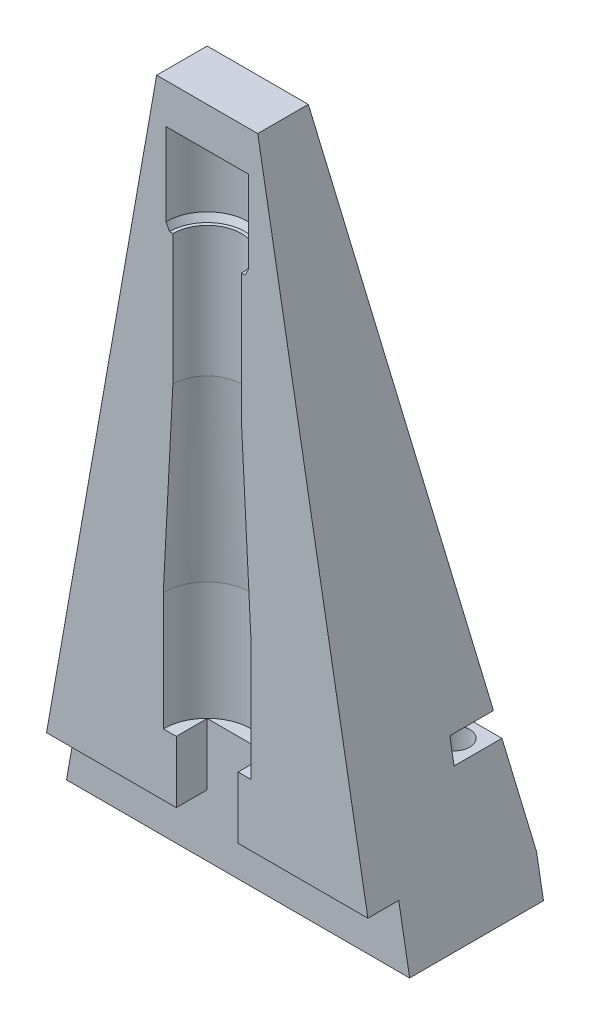
ISO-10303-21;
HEADER;
FILE_DESCRIPTION(('STEP AP214'),'2;1');
FILE_NAME('part.step','',(''),(''),'','','');
FILE_SCHEMA(('AUTOMOTIVE_DESIGN { 1 0 10303 214 1 1 1 1 }'));
ENDSEC;
DATA;
#1=APPLICATION_CONTEXT('core data for automotive mechanical design processes');
#2=APPLICATION_PROTOCOL_DEFINITION('international standard','automotive_design',2000,#1);
#3=PRODUCT_CONTEXT('',#1,'mechanical');
#4=PRODUCT('Part','Part','',(#3));
#5=PRODUCT_RELATED_PRODUCT_CATEGORY('part','',(#4));
#6=PRODUCT_DEFINITION_FORMATION('','',#4);
#7=PRODUCT_DEFINITION_CONTEXT('part definition',#1,'design');
#8=PRODUCT_DEFINITION('design','',#6,#7);
#9=PRODUCT_DEFINITION_SHAPE('','',#8);
#10=(LENGTH_UNIT() NAMED_UNIT(*) SI_UNIT(.MILLI.,.METRE.));
#11=(NAMED_UNIT(*) PLANE_ANGLE_UNIT() SI_UNIT($,.RADIAN.));
#12=(NAMED_UNIT(*) SI_UNIT($,.STERADIAN.) SOLID_ANGLE_UNIT());
#13=UNCERTAINTY_MEASURE_WITH_UNIT(LENGTH_MEASURE(1.E-05),#10,'distance_accuracy_value','');
#14=(GEOMETRIC_REPRESENTATION_CONTEXT(3) GLOBAL_UNCERTAINTY_ASSIGNED_CONTEXT((#13)) GLOBAL_UNIT_ASSIGNED_CONTEXT((#10,
#11,#12)) REPRESENTATION_CONTEXT('',''));
#15=CARTESIAN_POINT('',(0.,0.,0.));
#16=DIRECTION('',(0.,0.,1.));
#17=DIRECTION('',(1.,0.,0.));
#18=AXIS2_PLACEMENT_3D('',#15,#16,#17);
#19=CARTESIAN_POINT('',(-25.,0.,-25.));
#20=DIRECTION('',(0.,0.17364817766693,-0.984807753012208));
#21=DIRECTION('',(0.,0.984807753012208,0.17364817766693));
#22=AXIS2_PLACEMENT_3D('',#19,#20,#21);
#23=PLANE('',#22);
#24=DIRECTION('',(0.171087869746036,-0.970287525247814,-0.171087869746036));
#25=VECTOR('',#24,1.);
#26=CARTESIAN_POINT('',(23.5364470412882,8.30022128679006,-23.5364470412882));
#27=LINE('',#26,#25);
#28=CARTESIAN_POINT('',(21.4734603858307,20.,-21.4734603858307));
#29=VERTEX_POINT('',#28);
#30=CARTESIAN_POINT('',(24.,5.6712818196179,-24.));
#31=VERTEX_POINT('',#30);
#32=EDGE_CURVE('E265',#29,#31,#27,.T.);
#33=ORIENTED_EDGE('',*,*,#32,.T.);
#34=DIRECTION('',(1.,0.,0.));
#35=VECTOR('',#34,1.);
#36=CARTESIAN_POINT('',(-25.,5.67128181961774,-24.));
#37=LINE('',#36,#35);
#38=CARTESIAN_POINT('',(-24.,5.67128181961774,-24.));
#39=VERTEX_POINT('',#38);
#40=EDGE_CURVE('E247',#31,#39,#37,.F.);
#41=ORIENTED_EDGE('',*,*,#40,.T.);
#42=DIRECTION('',(-0.171087869746036,-0.970287525247814,-0.171087869746036));
#43=VECTOR('',#42,1.);
#44=CARTESIAN_POINT('',(-25.,0.,-25.));
#45=LINE('',#44,#43);
#46=CARTESIAN_POINT('',(-21.4734603858307,20.,-21.4734603858307));
#47=VERTEX_POINT('',#46);
#48=EDGE_CURVE('E246',#47,#39,#45,.T.);
#49=ORIENTED_EDGE('',*,*,#48,.F.);
#50=DIRECTION('',(1.,0.,0.));
#51=VECTOR('',#50,1.);
#52=CARTESIAN_POINT('',(-25.,20.,-21.4734603858307));
#53=LINE('',#52,#51);
#54=CARTESIAN_POINT('',(-14.5,20.,-21.4734603858307));
#55=VERTEX_POINT('',#54);
#56=EDGE_CURVE('E401',#55,#47,#53,.F.);
#57=ORIENTED_EDGE('',*,*,#56,.F.);
#58=DIRECTION('',(0.,0.984807753012208,0.17364817766693));
#59=VECTOR('',#58,1.);
#60=CARTESIAN_POINT('',(-14.5,0.,-25.));
#61=LINE('',#60,#59);
#62=CARTESIAN_POINT('',(-14.5,23.5,-20.8563159533511));
#63=VERTEX_POINT('',#62);
#64=EDGE_CURVE('E340',#63,#55,#61,.F.);
#65=ORIENTED_EDGE('',*,*,#64,.F.);
#66=DIRECTION('',(-1.,0.,0.));
#67=VECTOR('',#66,1.);
#68=CARTESIAN_POINT('',(-25.,23.5,-20.8563159533511));
#69=LINE('',#68,#67);
#70=CARTESIAN_POINT('',(-20.8563159533511,23.5,-20.8563159533511));
#71=VERTEX_POINT('',#70);
#72=EDGE_CURVE('E399',#71,#63,#69,.F.);
#73=ORIENTED_EDGE('',*,*,#72,.F.);
#74=CARTESIAN_POINT('',(-7.3673019291535,100.,-7.3673019291535));
#75=VERTEX_POINT('',#74);
#76=EDGE_CURVE('E266',#75,#71,#45,.T.);
#77=ORIENTED_EDGE('',*,*,#76,.F.);
#78=DIRECTION('',(1.,0.,0.));
#79=VECTOR('',#78,1.);
#80=CARTESIAN_POINT('',(-25.,100.,-7.3673019291535));
#81=LINE('',#80,#79);
#82=CARTESIAN_POINT('',(7.36730192915349,100.,-7.3673019291535));
#83=VERTEX_POINT('',#82);
#84=EDGE_CURVE('E255',#83,#75,#81,.F.);
#85=ORIENTED_EDGE('',*,*,#84,.F.);
#86=CARTESIAN_POINT('',(20.8563159533511,23.5,-20.8563159533511));
#87=VERTEX_POINT('',#86);
#88=EDGE_CURVE('E261',#83,#87,#27,.T.);
#89=ORIENTED_EDGE('',*,*,#88,.T.);
#90=DIRECTION('',(1.,0.,0.));
#91=VECTOR('',#90,1.);
#92=CARTESIAN_POINT('',(-25.,23.5,-20.8563159533511));
#93=LINE('',#92,#91);
#94=CARTESIAN_POINT('',(14.5,23.5,-20.8563159533511));
#95=VERTEX_POINT('',#94);
#96=EDGE_CURVE('E356',#87,#95,#93,.F.);
#97=ORIENTED_EDGE('',*,*,#96,.T.);
#98=DIRECTION('',(0.,0.984807753012208,0.17364817766693));
#99=VECTOR('',#98,1.);
#100=CARTESIAN_POINT('',(14.5,0.,-25.));
#101=LINE('',#100,#99);
#102=CARTESIAN_POINT('',(14.5,20.,-21.4734603858307));
#103=VERTEX_POINT('',#102);
#104=EDGE_CURVE('E68',#95,#103,#101,.F.);
#105=ORIENTED_EDGE('',*,*,#104,.T.);
#106=DIRECTION('',(-1.,0.,0.));
#107=VECTOR('',#106,1.);
#108=CARTESIAN_POINT('',(-25.,20.,-21.4734603858307));
#109=LINE('',#108,#107);
#110=EDGE_CURVE('E354',#103,#29,#109,.F.);
#111=ORIENTED_EDGE('',*,*,#110,.T.);
#112=EDGE_LOOP('',(#33,#41,#49,#57,#65,#73,#77,#85,#89,#97,#105,#111));
#113=FACE_BOUND('',#112,.T.);
#114=ADVANCED_FACE('F60',(#113),#23,.T.);
#115=CARTESIAN_POINT('',(-25.,0.,-25.));
#116=DIRECTION('',(-0.984807753012208,0.17364817766693,0.));
#117=DIRECTION('',(-0.17364817766693,-0.984807753012208,0.));
#118=AXIS2_PLACEMENT_3D('',#115,#116,#117);
#119=PLANE('',#118);
#120=ORIENTED_EDGE('',*,*,#48,.T.);
#121=DIRECTION('',(0.17364817766693,0.984807753012208,0.));
#122=VECTOR('',#121,1.);
#123=CARTESIAN_POINT('',(-25.,0.,-24.));
#124=LINE('',#123,#122);
#125=CARTESIAN_POINT('',(-25.,0.,-24.));
#126=VERTEX_POINT('',#125);
#127=EDGE_CURVE('E232',#39,#126,#124,.F.);
#128=ORIENTED_EDGE('',*,*,#127,.T.);
#129=DIRECTION('',(0.,0.,1.));
#130=VECTOR('',#129,1.);
#131=CARTESIAN_POINT('',(-25.,0.,-25.));
#132=LINE('',#131,#130);
#133=CARTESIAN_POINT('',(-25.,0.,-4.5));
#134=VERTEX_POINT('',#133);
#135=EDGE_CURVE('E242',#126,#134,#132,.T.);
#136=ORIENTED_EDGE('',*,*,#135,.T.);
#137=DIRECTION('',(-0.17364817766693,-0.984807753012208,0.));
#138=VECTOR('',#137,1.);
#139=CARTESIAN_POINT('',(-25.,0.,-4.5));
#140=LINE('',#139,#138);
#141=CARTESIAN_POINT('',(-23.4130571736238,9.,-4.5));
#142=VERTEX_POINT('',#141);
#143=EDGE_CURVE('E433',#134,#142,#140,.F.);
#144=ORIENTED_EDGE('',*,*,#143,.T.);
#145=DIRECTION('',(0.,0.,-1.));
#146=VECTOR('',#145,1.);
#147=CARTESIAN_POINT('',(-23.4130571736238,9.,-25.));
#148=LINE('',#147,#146);
#149=CARTESIAN_POINT('',(-23.4130571736238,9.,0.));
#150=VERTEX_POINT('',#149);
#151=EDGE_CURVE('E427',#142,#150,#148,.F.);
#152=ORIENTED_EDGE('',*,*,#151,.T.);
#153=DIRECTION('',(-0.17364817766693,-0.984807753012208,0.));
#154=VECTOR('',#153,1.);
#155=CARTESIAN_POINT('',(-25.,0.,0.));
#156=LINE('',#155,#154);
#157=CARTESIAN_POINT('',(-7.3673019291535,100.,0.));
#158=VERTEX_POINT('',#157);
#159=EDGE_CURVE('E438',#150,#158,#156,.F.);
#160=ORIENTED_EDGE('',*,*,#159,.T.);
#161=DIRECTION('',(0.,0.,-1.));
#162=VECTOR('',#161,1.);
#163=CARTESIAN_POINT('',(-7.3673019291535,100.,-25.));
#164=LINE('',#163,#162);
#165=EDGE_CURVE('E270',#75,#158,#164,.F.);
#166=ORIENTED_EDGE('',*,*,#165,.F.);
#167=ORIENTED_EDGE('',*,*,#76,.T.);
#168=DIRECTION('',(0.,0.,1.));
#169=VECTOR('',#168,1.);
#170=CARTESIAN_POINT('',(-20.8563159533511,23.5,-25.));
#171=LINE('',#170,#169);
#172=CARTESIAN_POINT('',(-20.8563159533511,23.5,-14.5));
#173=VERTEX_POINT('',#172);
#174=EDGE_CURVE('E335',#173,#71,#171,.F.);
#175=ORIENTED_EDGE('',*,*,#174,.F.);
#176=DIRECTION('',(-0.17364817766693,-0.984807753012208,0.));
#177=VECTOR('',#176,1.);
#178=CARTESIAN_POINT('',(-25.,0.,-14.5));
#179=LINE('',#178,#177);
#180=CARTESIAN_POINT('',(-21.4734603858307,20.,-14.5));
#181=VERTEX_POINT('',#180);
#182=EDGE_CURVE('E333',#181,#173,#179,.F.);
#183=ORIENTED_EDGE('',*,*,#182,.F.);
#184=DIRECTION('',(0.,0.,-1.));
#185=VECTOR('',#184,1.);
#186=CARTESIAN_POINT('',(-21.4734603858307,20.,-25.));
#187=LINE('',#186,#185);
#188=EDGE_CURVE('E337',#47,#181,#187,.F.);
#189=ORIENTED_EDGE('',*,*,#188,.F.);
#190=EDGE_LOOP('',(#120,#128,#136,#144,#152,#160,#166,#167,#175,#183,#189));
#191=FACE_BOUND('',#190,.T.);
#192=ADVANCED_FACE('F240',(#191),#119,.T.);
#193=CARTESIAN_POINT('',(0.,0.,0.));
#194=DIRECTION('',(0.,0.,-1.));
#195=DIRECTION('',(-1.,0.,0.));
#196=AXIS2_PLACEMENT_3D('',#193,#194,#195);
#197=PLANE('',#196);
#198=ORIENTED_EDGE('',*,*,#159,.F.);
#199=DIRECTION('',(-1.,0.,0.));
#200=VECTOR('',#199,1.);
#201=CARTESIAN_POINT('',(25.,9.,0.));
#202=LINE('',#201,#200);
#203=CARTESIAN_POINT('',(-4.5,9.,0.));
#204=VERTEX_POINT('',#203);
#205=EDGE_CURVE('E420',#204,#150,#202,.T.);
#206=ORIENTED_EDGE('',*,*,#205,.F.);
#207=DIRECTION('',(0.,1.,0.));
#208=VECTOR('',#207,1.);
#209=CARTESIAN_POINT('',(-4.5,30.2638391437749,0.));
#210=LINE('',#209,#208);
#211=CARTESIAN_POINT('',(-4.5,18.,0.));
#212=VERTEX_POINT('',#211);
#213=EDGE_CURVE('E331',#212,#204,#210,.F.);
#214=ORIENTED_EDGE('',*,*,#213,.F.);
#215=DIRECTION('',(-1.,0.,0.));
#216=VECTOR('',#215,1.);
#217=CARTESIAN_POINT('',(0.,18.,0.));
#218=LINE('',#217,#216);
#219=CARTESIAN_POINT('',(-6.4,18.,0.));
#220=VERTEX_POINT('',#219);
#221=EDGE_CURVE('E276',#212,#220,#218,.T.);
#222=ORIENTED_EDGE('',*,*,#221,.T.);
#223=DIRECTION('',(0.,1.,0.));
#224=VECTOR('',#223,1.);
#225=CARTESIAN_POINT('',(-6.4,26.5999999999994,0.));
#226=LINE('',#225,#224);
#227=CARTESIAN_POINT('',(-6.4,35.1999999999987,0.));
#228=VERTEX_POINT('',#227);
#229=EDGE_CURVE('E298',#220,#228,#226,.T.);
#230=ORIENTED_EDGE('',*,*,#229,.T.);
#231=DIRECTION('',(0.0517822872732978,0.998658397413623,0.));
#232=VECTOR('',#231,1.);
#233=CARTESIAN_POINT('',(0.,158.628571428573,0.));
#234=LINE('',#233,#232);
#235=CARTESIAN_POINT('',(-4.99999999999999,62.2,0.));
#236=VERTEX_POINT('',#235);
#237=EDGE_CURVE('E300',#228,#236,#234,.T.);
#238=ORIENTED_EDGE('',*,*,#237,.T.);
#239=DIRECTION('',(0.,1.,0.));
#240=VECTOR('',#239,1.);
#241=CARTESIAN_POINT('',(-5.,71.7,0.));
#242=LINE('',#241,#240);
#243=CARTESIAN_POINT('',(-5.,81.2,0.));
#244=VERTEX_POINT('',#243);
#245=EDGE_CURVE('E302',#236,#244,#242,.T.);
#246=ORIENTED_EDGE('',*,*,#245,.T.);
#247=DIRECTION('',(-1.,0.,0.));
#248=VECTOR('',#247,1.);
#249=CARTESIAN_POINT('',(0.,81.2,0.));
#250=LINE('',#249,#248);
#251=CARTESIAN_POINT('',(-5.5,81.2,0.));
#252=VERTEX_POINT('',#251);
#253=EDGE_CURVE('E289',#244,#252,#250,.T.);
#254=ORIENTED_EDGE('',*,*,#253,.T.);
#255=DIRECTION('',(-0.447213595499959,0.894427190999916,0.));
#256=VECTOR('',#255,1.);
#257=CARTESIAN_POINT('',(0.,70.2,0.));
#258=LINE('',#257,#256);
#259=CARTESIAN_POINT('',(-5.99999999999999,82.2,0.));
#260=VERTEX_POINT('',#259);
#261=EDGE_CURVE('E304',#252,#260,#258,.T.);
#262=ORIENTED_EDGE('',*,*,#261,.T.);
#263=DIRECTION('',(0.,1.,0.));
#264=VECTOR('',#263,1.);
#265=CARTESIAN_POINT('',(-6.,88.2,0.));
#266=LINE('',#265,#264);
#267=CARTESIAN_POINT('',(-6.,94.2,0.));
#268=VERTEX_POINT('',#267);
#269=EDGE_CURVE('E306',#260,#268,#266,.T.);
#270=ORIENTED_EDGE('',*,*,#269,.T.);
#271=DIRECTION('',(1.,0.,0.));
#272=VECTOR('',#271,1.);
#273=CARTESIAN_POINT('',(0.,94.2,0.));
#274=LINE('',#273,#272);
#275=CARTESIAN_POINT('',(6.,94.2,0.));
#276=VERTEX_POINT('',#275);
#277=EDGE_CURVE('E295',#268,#276,#274,.T.);
#278=ORIENTED_EDGE('',*,*,#277,.T.);
#279=DIRECTION('',(0.,1.,0.));
#280=VECTOR('',#279,1.);
#281=CARTESIAN_POINT('',(6.,88.2,0.));
#282=LINE('',#281,#280);
#283=CARTESIAN_POINT('',(5.99999999999999,82.2,0.));
#284=VERTEX_POINT('',#283);
#285=EDGE_CURVE('E292',#276,#284,#282,.F.);
#286=ORIENTED_EDGE('',*,*,#285,.T.);
#287=DIRECTION('',(-0.447213595499959,-0.894427190999916,0.));
#288=VECTOR('',#287,1.);
#289=CARTESIAN_POINT('',(0.,70.2,0.));
#290=LINE('',#289,#288);
#291=CARTESIAN_POINT('',(5.5,81.2,0.));
#292=VERTEX_POINT('',#291);
#293=EDGE_CURVE('E288',#284,#292,#290,.T.);
#294=ORIENTED_EDGE('',*,*,#293,.T.);
#295=CARTESIAN_POINT('',(5.,81.2,0.));
#296=VERTEX_POINT('',#295);
#297=EDGE_CURVE('E285',#292,#296,#250,.T.);
#298=ORIENTED_EDGE('',*,*,#297,.T.);
#299=DIRECTION('',(0.,1.,0.));
#300=VECTOR('',#299,1.);
#301=CARTESIAN_POINT('',(5.,71.7,0.));
#302=LINE('',#301,#300);
#303=CARTESIAN_POINT('',(4.99999999999999,62.2,0.));
#304=VERTEX_POINT('',#303);
#305=EDGE_CURVE('E282',#296,#304,#302,.F.);
#306=ORIENTED_EDGE('',*,*,#305,.T.);
#307=DIRECTION('',(0.0517822872732978,-0.998658397413623,0.));
#308=VECTOR('',#307,1.);
#309=CARTESIAN_POINT('',(0.,158.628571428573,0.));
#310=LINE('',#309,#308);
#311=CARTESIAN_POINT('',(6.4,35.1999999999987,0.));
#312=VERTEX_POINT('',#311);
#313=EDGE_CURVE('E279',#304,#312,#310,.T.);
#314=ORIENTED_EDGE('',*,*,#313,.T.);
#315=DIRECTION('',(0.,1.,0.));
#316=VECTOR('',#315,1.);
#317=CARTESIAN_POINT('',(6.4,26.5999999999994,0.));
#318=LINE('',#317,#316);
#319=CARTESIAN_POINT('',(6.4,18.,0.));
#320=VERTEX_POINT('',#319);
#321=EDGE_CURVE('E275',#312,#320,#318,.F.);
#322=ORIENTED_EDGE('',*,*,#321,.T.);
#323=CARTESIAN_POINT('',(4.5,18.,0.));
#324=VERTEX_POINT('',#323);
#325=EDGE_CURVE('E264',#320,#324,#218,.T.);
#326=ORIENTED_EDGE('',*,*,#325,.T.);
#327=DIRECTION('',(0.,1.,0.));
#328=VECTOR('',#327,1.);
#329=CARTESIAN_POINT('',(4.5,30.2638391437749,0.));
#330=LINE('',#329,#328);
#331=CARTESIAN_POINT('',(4.5,9.,0.));
#332=VERTEX_POINT('',#331);
#333=EDGE_CURVE('E320',#332,#324,#330,.T.);
#334=ORIENTED_EDGE('',*,*,#333,.F.);
#335=CARTESIAN_POINT('',(23.4130571736238,9.,0.));
#336=VERTEX_POINT('',#335);
#337=EDGE_CURVE('E422',#336,#332,#202,.T.);
#338=ORIENTED_EDGE('',*,*,#337,.F.);
#339=DIRECTION('',(-0.17364817766693,0.984807753012208,0.));
#340=VECTOR('',#339,1.);
#341=CARTESIAN_POINT('',(25.,0.,0.));
#342=LINE('',#341,#340);
#343=CARTESIAN_POINT('',(7.3673019291535,100.,0.));
#344=VERTEX_POINT('',#343);
#345=EDGE_CURVE('E440',#344,#336,#342,.F.);
#346=ORIENTED_EDGE('',*,*,#345,.F.);
#347=DIRECTION('',(-1.,0.,0.));
#348=VECTOR('',#347,1.);
#349=CARTESIAN_POINT('',(0.,100.,0.));
#350=LINE('',#349,#348);
#351=EDGE_CURVE('E257',#344,#158,#350,.T.);
#352=ORIENTED_EDGE('',*,*,#351,.T.);
#353=EDGE_LOOP('',(#198,#206,#214,#222,#230,#238,#246,#254,#262,#270,#278,#286,#294,#298,#306,
#314,#322,#326,#334,#338,#346,#352));
#354=FACE_BOUND('',#353,.T.);
#355=ADVANCED_FACE('F446',(#354),#197,.F.);
#356=CARTESIAN_POINT('',(-6.4,18.,0.));
#357=DIRECTION('',(0.,-1.,0.));
#358=DIRECTION('',(0.,0.,1.));
#359=AXIS2_PLACEMENT_3D('',#356,#357,#358);
#360=PLANE('',#359);
#361=DIRECTION('',(-1.,0.,0.));
#362=VECTOR('',#361,1.);
#363=CARTESIAN_POINT('',(-4.5,18.,-4.5));
#364=LINE('',#363,#362);
#365=CARTESIAN_POINT('',(4.5,18.,-4.5));
#366=VERTEX_POINT('',#365);
#367=CARTESIAN_POINT('',(-4.5,18.,-4.5));
#368=VERTEX_POINT('',#367);
#369=EDGE_CURVE('E408',#366,#368,#364,.T.);
#370=ORIENTED_EDGE('',*,*,#369,.F.);
#371=DIRECTION('',(0.,0.,1.));
#372=VECTOR('',#371,1.);
#373=CARTESIAN_POINT('',(4.5,18.,-17.2279220613579));
#374=LINE('',#373,#372);
#375=EDGE_CURVE('E410',#366,#324,#374,.T.);
#376=ORIENTED_EDGE('',*,*,#375,.T.);
#377=ORIENTED_EDGE('',*,*,#325,.F.);
#378=CARTESIAN_POINT('',(0.,18.,0.));
#379=DIRECTION('',(0.,1.,0.));
#380=DIRECTION('',(0.,0.,-1.));
#381=AXIS2_PLACEMENT_3D('',#378,#379,#380);
#382=CIRCLE('',#381,6.4);
#383=EDGE_CURVE('E317',#320,#220,#382,.T.);
#384=ORIENTED_EDGE('',*,*,#383,.T.);
#385=ORIENTED_EDGE('',*,*,#221,.F.);
#386=DIRECTION('',(0.,0.,1.));
#387=VECTOR('',#386,1.);
#388=CARTESIAN_POINT('',(-4.5,18.,-17.2279220613579));
#389=LINE('',#388,#387);
#390=EDGE_CURVE('E407',#368,#212,#389,.T.);
#391=ORIENTED_EDGE('',*,*,#390,.F.);
#392=EDGE_LOOP('',(#370,#376,#377,#384,#385,#391));
#393=FACE_BOUND('',#392,.T.);
#394=ADVANCED_FACE('F472',(#393),#360,.F.);
#395=CARTESIAN_POINT('',(0.,26.5999999999994,0.));
#396=DIRECTION('',(0.,1.,0.));
#397=DIRECTION('',(-1.,0.,0.));
#398=AXIS2_PLACEMENT_3D('',#395,#396,#397);
#399=CYLINDRICAL_SURFACE('',#398,6.4);
#400=ORIENTED_EDGE('',*,*,#383,.F.);
#401=ORIENTED_EDGE('',*,*,#321,.F.);
#402=CARTESIAN_POINT('',(0.,35.1999999999987,0.));
#403=DIRECTION('',(0.,1.,0.));
#404=DIRECTION('',(0.,0.,-1.));
#405=AXIS2_PLACEMENT_3D('',#402,#403,#404);
#406=CIRCLE('',#405,6.4);
#407=EDGE_CURVE('E315',#312,#228,#406,.T.);
#408=ORIENTED_EDGE('',*,*,#407,.T.);
#409=ORIENTED_EDGE('',*,*,#229,.F.);
#410=EDGE_LOOP('',(#400,#401,#408,#409));
#411=FACE_BOUND('',#410,.T.);
#412=ADVANCED_FACE('F475',(#411),#399,.F.);
#413=CARTESIAN_POINT('',(0.,48.6999999999994,0.));
#414=DIRECTION('',(0.,-1.,0.));
#415=DIRECTION('',(-1.,0.,0.));
#416=AXIS2_PLACEMENT_3D('',#413,#414,#415);
#417=CONICAL_SURFACE('',#416,5.7,0.051805456791);
#418=ORIENTED_EDGE('',*,*,#407,.F.);
#419=ORIENTED_EDGE('',*,*,#313,.F.);
#420=CARTESIAN_POINT('',(0.,62.2,0.));
#421=DIRECTION('',(0.,1.,0.));
#422=DIRECTION('',(0.,0.,-1.));
#423=AXIS2_PLACEMENT_3D('',#420,#421,#422);
#424=CIRCLE('',#423,5.);
#425=EDGE_CURVE('E312',#304,#236,#424,.T.);
#426=ORIENTED_EDGE('',*,*,#425,.T.);
#427=ORIENTED_EDGE('',*,*,#237,.F.);
#428=EDGE_LOOP('',(#418,#419,#426,#427));
#429=FACE_BOUND('',#428,.T.);
#430=ADVANCED_FACE('F480',(#429),#417,.F.);
#431=CARTESIAN_POINT('',(0.,71.7,0.));
#432=DIRECTION('',(0.,1.,0.));
#433=DIRECTION('',(-1.,0.,0.));
#434=AXIS2_PLACEMENT_3D('',#431,#432,#433);
#435=CYLINDRICAL_SURFACE('',#434,5.);
#436=ORIENTED_EDGE('',*,*,#425,.F.);
#437=ORIENTED_EDGE('',*,*,#305,.F.);
#438=CARTESIAN_POINT('',(0.,81.2,0.));
#439=DIRECTION('',(0.,1.,0.));
#440=DIRECTION('',(0.,0.,-1.));
#441=AXIS2_PLACEMENT_3D('',#438,#439,#440);
#442=CIRCLE('',#441,5.);
#443=EDGE_CURVE('E316',#296,#244,#442,.T.);
#444=ORIENTED_EDGE('',*,*,#443,.T.);
#445=ORIENTED_EDGE('',*,*,#245,.F.);
#446=EDGE_LOOP('',(#436,#437,#444,#445));
#447=FACE_BOUND('',#446,.T.);
#448=ADVANCED_FACE('F483',(#447),#435,.F.);
#449=CARTESIAN_POINT('',(-5.5,81.2,0.));
#450=DIRECTION('',(0.,-1.,0.));
#451=DIRECTION('',(0.,0.,1.));
#452=AXIS2_PLACEMENT_3D('',#449,#450,#451);
#453=PLANE('',#452);
#454=CARTESIAN_POINT('',(0.,81.2,0.));
#455=DIRECTION('',(0.,1.,0.));
#456=DIRECTION('',(0.,0.,-1.));
#457=AXIS2_PLACEMENT_3D('',#454,#455,#456);
#458=CIRCLE('',#457,5.5);
#459=EDGE_CURVE('E323',#292,#252,#458,.T.);
#460=ORIENTED_EDGE('',*,*,#459,.T.);
#461=ORIENTED_EDGE('',*,*,#253,.F.);
#462=ORIENTED_EDGE('',*,*,#443,.F.);
#463=ORIENTED_EDGE('',*,*,#297,.F.);
#464=EDGE_LOOP('',(#460,#461,#462,#463));
#465=FACE_BOUND('',#464,.T.);
#466=ADVANCED_FACE('F493',(#465),#453,.F.);
#467=CARTESIAN_POINT('',(0.,81.7,0.));
#468=DIRECTION('',(0.,1.,0.));
#469=DIRECTION('',(-1.,0.,0.));
#470=AXIS2_PLACEMENT_3D('',#467,#468,#469);
#471=CONICAL_SURFACE('',#470,5.75,0.463647609000807);
#472=ORIENTED_EDGE('',*,*,#459,.F.);
#473=ORIENTED_EDGE('',*,*,#293,.F.);
#474=CARTESIAN_POINT('',(0.,82.2,0.));
#475=DIRECTION('',(0.,1.,0.));
#476=DIRECTION('',(0.,0.,-1.));
#477=AXIS2_PLACEMENT_3D('',#474,#475,#476);
#478=CIRCLE('',#477,6.);
#479=EDGE_CURVE('E311',#284,#260,#478,.T.);
#480=ORIENTED_EDGE('',*,*,#479,.T.);
#481=ORIENTED_EDGE('',*,*,#261,.F.);
#482=EDGE_LOOP('',(#472,#473,#480,#481));
#483=FACE_BOUND('',#482,.T.);
#484=ADVANCED_FACE('F491',(#483),#471,.F.);
#485=CARTESIAN_POINT('',(0.,88.2,0.));
#486=DIRECTION('',(0.,1.,0.));
#487=DIRECTION('',(-1.,0.,0.));
#488=AXIS2_PLACEMENT_3D('',#485,#486,#487);
#489=CYLINDRICAL_SURFACE('',#488,6.);
#490=ORIENTED_EDGE('',*,*,#479,.F.);
#491=ORIENTED_EDGE('',*,*,#285,.F.);
#492=CARTESIAN_POINT('',(0.,94.2,0.));
#493=DIRECTION('',(0.,1.,0.));
#494=DIRECTION('',(0.,0.,-1.));
#495=AXIS2_PLACEMENT_3D('',#492,#493,#494);
#496=CIRCLE('',#495,6.);
#497=EDGE_CURVE('E308',#276,#268,#496,.T.);
#498=ORIENTED_EDGE('',*,*,#497,.T.);
#499=ORIENTED_EDGE('',*,*,#269,.F.);
#500=EDGE_LOOP('',(#490,#491,#498,#499));
#501=FACE_BOUND('',#500,.T.);
#502=ADVANCED_FACE('F497',(#501),#489,.F.);
#503=CARTESIAN_POINT('',(0.,94.2,0.));
#504=DIRECTION('',(0.,1.,0.));
#505=DIRECTION('',(-1.,0.,0.));
#506=AXIS2_PLACEMENT_3D('',#503,#504,#505);
#507=PLANE('',#506);
#508=ORIENTED_EDGE('',*,*,#497,.F.);
#509=ORIENTED_EDGE('',*,*,#277,.F.);
#510=EDGE_LOOP('',(#508,#509));
#511=FACE_BOUND('',#510,.T.);
#512=ADVANCED_FACE('F62',(#511),#507,.F.);
#513=CARTESIAN_POINT('',(25.,0.,-25.));
#514=DIRECTION('',(0.984807753012208,0.17364817766693,0.));
#515=DIRECTION('',(-0.17364817766693,0.984807753012208,0.));
#516=AXIS2_PLACEMENT_3D('',#513,#514,#515);
#517=PLANE('',#516);
#518=DIRECTION('',(0.,0.,-1.));
#519=VECTOR('',#518,1.);
#520=CARTESIAN_POINT('',(25.,0.,-25.));
#521=LINE('',#520,#519);
#522=CARTESIAN_POINT('',(25.,0.,-4.5));
#523=VERTEX_POINT('',#522);
#524=CARTESIAN_POINT('',(25.,0.,-24.));
#525=VERTEX_POINT('',#524);
#526=EDGE_CURVE('E253',#523,#525,#521,.T.);
#527=ORIENTED_EDGE('',*,*,#526,.T.);
#528=DIRECTION('',(0.17364817766693,-0.984807753012208,0.));
#529=VECTOR('',#528,1.);
#530=CARTESIAN_POINT('',(25.,0.,-24.));
#531=LINE('',#530,#529);
#532=EDGE_CURVE('E75',#525,#31,#531,.F.);
#533=ORIENTED_EDGE('',*,*,#532,.T.);
#534=ORIENTED_EDGE('',*,*,#32,.F.);
#535=DIRECTION('',(0.,0.,-1.));
#536=VECTOR('',#535,1.);
#537=CARTESIAN_POINT('',(21.4734603858307,20.,-25.));
#538=LINE('',#537,#536);
#539=CARTESIAN_POINT('',(21.4734603858307,20.,-14.5));
#540=VERTEX_POINT('',#539);
#541=EDGE_CURVE('E344',#29,#540,#538,.F.);
#542=ORIENTED_EDGE('',*,*,#541,.T.);
#543=DIRECTION('',(-0.17364817766693,0.984807753012208,0.));
#544=VECTOR('',#543,1.);
#545=CARTESIAN_POINT('',(25.,0.,-14.5));
#546=LINE('',#545,#544);
#547=CARTESIAN_POINT('',(20.8563159533511,23.5,-14.5));
#548=VERTEX_POINT('',#547);
#549=EDGE_CURVE('E342',#548,#540,#546,.F.);
#550=ORIENTED_EDGE('',*,*,#549,.F.);
#551=DIRECTION('',(0.,0.,1.));
#552=VECTOR('',#551,1.);
#553=CARTESIAN_POINT('',(20.8563159533511,23.5,-25.));
#554=LINE('',#553,#552);
#555=EDGE_CURVE('E347',#548,#87,#554,.F.);
#556=ORIENTED_EDGE('',*,*,#555,.T.);
#557=ORIENTED_EDGE('',*,*,#88,.F.);
#558=DIRECTION('',(0.,0.,1.));
#559=VECTOR('',#558,1.);
#560=CARTESIAN_POINT('',(7.36730192915349,100.,-25.));
#561=LINE('',#560,#559);
#562=EDGE_CURVE('E252',#344,#83,#561,.F.);
#563=ORIENTED_EDGE('',*,*,#562,.F.);
#564=ORIENTED_EDGE('',*,*,#345,.T.);
#565=DIRECTION('',(0.,0.,1.));
#566=VECTOR('',#565,1.);
#567=CARTESIAN_POINT('',(23.4130571736238,9.,-25.));
#568=LINE('',#567,#566);
#569=CARTESIAN_POINT('',(23.4130571736238,9.,-4.5));
#570=VERTEX_POINT('',#569);
#571=EDGE_CURVE('E430',#336,#570,#568,.F.);
#572=ORIENTED_EDGE('',*,*,#571,.T.);
#573=DIRECTION('',(-0.17364817766693,0.984807753012208,0.));
#574=VECTOR('',#573,1.);
#575=CARTESIAN_POINT('',(25.,0.,-4.5));
#576=LINE('',#575,#574);
#577=EDGE_CURVE('E435',#570,#523,#576,.F.);
#578=ORIENTED_EDGE('',*,*,#577,.T.);
#579=EDGE_LOOP('',(#527,#533,#534,#542,#550,#556,#557,#563,#564,#572,#578));
#580=FACE_BOUND('',#579,.T.);
#581=ADVANCED_FACE('F500',(#580),#517,.T.);
#582=CARTESIAN_POINT('',(0.,100.,0.));
#583=DIRECTION('',(0.,1.,0.));
#584=DIRECTION('',(0.,0.,1.));
#585=AXIS2_PLACEMENT_3D('',#582,#583,#584);
#586=PLANE('',#585);
#587=ORIENTED_EDGE('',*,*,#351,.F.);
#588=ORIENTED_EDGE('',*,*,#562,.T.);
#589=ORIENTED_EDGE('',*,*,#84,.T.);
#590=ORIENTED_EDGE('',*,*,#165,.T.);
#591=EDGE_LOOP('',(#587,#588,#589,#590));
#592=FACE_BOUND('',#591,.T.);
#593=ADVANCED_FACE('F452',(#592),#586,.T.);
#594=CARTESIAN_POINT('',(0.,0.,0.));
#595=DIRECTION('',(0.,1.,0.));
#596=DIRECTION('',(0.,0.,1.));
#597=AXIS2_PLACEMENT_3D('',#594,#595,#596);
#598=PLANE('',#597);
#599=CARTESIAN_POINT('',(-18.,0.,-18.));
#600=DIRECTION('',(0.,-1.,0.));
#601=DIRECTION('',(0.,0.,-1.));
#602=AXIS2_PLACEMENT_3D('',#599,#600,#601);
#603=CIRCLE('',#602,2.25);
#604=CARTESIAN_POINT('',(-18.,0.,-20.25));
#605=VERTEX_POINT('',#604);
#606=EDGE_CURVE('E380',#605,#605,#603,.T.);
#607=ORIENTED_EDGE('',*,*,#606,.F.);
#608=EDGE_LOOP('',(#607));
#609=FACE_BOUND('',#608,.T.);
#610=CARTESIAN_POINT('',(18.,0.,-18.));
#611=DIRECTION('',(0.,-1.,0.));
#612=DIRECTION('',(0.,0.,1.));
#613=AXIS2_PLACEMENT_3D('',#610,#611,#612);
#614=CIRCLE('',#613,2.25);
#615=CARTESIAN_POINT('',(18.,0.,-15.75));
#616=VERTEX_POINT('',#615);
#617=EDGE_CURVE('E375',#616,#616,#614,.T.);
#618=ORIENTED_EDGE('',*,*,#617,.F.);
#619=EDGE_LOOP('',(#618));
#620=FACE_BOUND('',#619,.T.);
#621=ORIENTED_EDGE('',*,*,#135,.F.);
#622=DIRECTION('',(1.,0.,0.));
#623=VECTOR('',#622,1.);
#624=CARTESIAN_POINT('',(0.,0.,-24.));
#625=LINE('',#624,#623);
#626=EDGE_CURVE('E11',#126,#525,#625,.T.);
#627=ORIENTED_EDGE('',*,*,#626,.T.);
#628=ORIENTED_EDGE('',*,*,#526,.F.);
#629=DIRECTION('',(1.,0.,0.));
#630=VECTOR('',#629,1.);
#631=CARTESIAN_POINT('',(25.,0.,-4.5));
#632=LINE('',#631,#630);
#633=EDGE_CURVE('E250',#134,#523,#632,.T.);
#634=ORIENTED_EDGE('',*,*,#633,.F.);
#635=EDGE_LOOP('',(#621,#627,#628,#634));
#636=FACE_BOUND('',#635,.T.);
#637=ADVANCED_FACE('F249',(#609,#620,#636),#598,.F.);
#638=CARTESIAN_POINT('',(25.,9.,-4.5));
#639=DIRECTION('',(0.,0.,-1.));
#640=DIRECTION('',(-1.,0.,0.));
#641=AXIS2_PLACEMENT_3D('',#638,#639,#640);
#642=PLANE('',#641);
#643=ORIENTED_EDGE('',*,*,#369,.T.);
#644=DIRECTION('',(0.,-1.,0.));
#645=VECTOR('',#644,1.);
#646=CARTESIAN_POINT('',(-4.5,18.,-4.5));
#647=LINE('',#646,#645);
#648=CARTESIAN_POINT('',(-4.5,9.,-4.5));
#649=VERTEX_POINT('',#648);
#650=EDGE_CURVE('E404',#368,#649,#647,.T.);
#651=ORIENTED_EDGE('',*,*,#650,.T.);
#652=DIRECTION('',(1.,0.,0.));
#653=VECTOR('',#652,1.);
#654=CARTESIAN_POINT('',(25.,9.,-4.5));
#655=LINE('',#654,#653);
#656=EDGE_CURVE('E425',#142,#649,#655,.T.);
#657=ORIENTED_EDGE('',*,*,#656,.F.);
#658=ORIENTED_EDGE('',*,*,#143,.F.);
#659=ORIENTED_EDGE('',*,*,#633,.T.);
#660=ORIENTED_EDGE('',*,*,#577,.F.);
#661=CARTESIAN_POINT('',(4.5,9.,-4.5));
#662=VERTEX_POINT('',#661);
#663=EDGE_CURVE('E423',#662,#570,#655,.T.);
#664=ORIENTED_EDGE('',*,*,#663,.F.);
#665=DIRECTION('',(0.,1.,0.));
#666=VECTOR('',#665,1.);
#667=CARTESIAN_POINT('',(4.5,18.,-4.5));
#668=LINE('',#667,#666);
#669=EDGE_CURVE('E411',#662,#366,#668,.T.);
#670=ORIENTED_EDGE('',*,*,#669,.T.);
#671=EDGE_LOOP('',(#643,#651,#657,#658,#659,#660,#664,#670));
#672=FACE_BOUND('',#671,.T.);
#673=ADVANCED_FACE('F461',(#672),#642,.F.);
#674=CARTESIAN_POINT('',(0.,9.,0.));
#675=DIRECTION('',(0.,1.,0.));
#676=DIRECTION('',(0.,0.,1.));
#677=AXIS2_PLACEMENT_3D('',#674,#675,#676);
#678=PLANE('',#677);
#679=ORIENTED_EDGE('',*,*,#337,.T.);
#680=DIRECTION('',(0.,0.,1.));
#681=VECTOR('',#680,1.);
#682=CARTESIAN_POINT('',(4.5,9.,-17.2279220613579));
#683=LINE('',#682,#681);
#684=EDGE_CURVE('E403',#662,#332,#683,.T.);
#685=ORIENTED_EDGE('',*,*,#684,.F.);
#686=ORIENTED_EDGE('',*,*,#663,.T.);
#687=ORIENTED_EDGE('',*,*,#571,.F.);
#688=EDGE_LOOP('',(#679,#685,#686,#687));
#689=FACE_BOUND('',#688,.T.);
#690=ADVANCED_FACE('F568',(#689),#678,.F.);
#691=ORIENTED_EDGE('',*,*,#656,.T.);
#692=DIRECTION('',(0.,0.,1.));
#693=VECTOR('',#692,1.);
#694=CARTESIAN_POINT('',(-4.5,9.,-17.2279220613579));
#695=LINE('',#694,#693);
#696=EDGE_CURVE('E406',#649,#204,#695,.T.);
#697=ORIENTED_EDGE('',*,*,#696,.T.);
#698=ORIENTED_EDGE('',*,*,#205,.T.);
#699=ORIENTED_EDGE('',*,*,#151,.F.);
#700=EDGE_LOOP('',(#691,#697,#698,#699));
#701=FACE_BOUND('',#700,.T.);
#702=ADVANCED_FACE('F459',(#701),#678,.F.);
#703=CARTESIAN_POINT('',(4.5,18.,-17.2279220613579));
#704=DIRECTION('',(1.,0.,0.));
#705=DIRECTION('',(0.,0.,-1.));
#706=AXIS2_PLACEMENT_3D('',#703,#704,#705);
#707=PLANE('',#706);
#708=ORIENTED_EDGE('',*,*,#684,.T.);
#709=ORIENTED_EDGE('',*,*,#333,.T.);
#710=ORIENTED_EDGE('',*,*,#375,.F.);
#711=ORIENTED_EDGE('',*,*,#669,.F.);
#712=EDGE_LOOP('',(#708,#709,#710,#711));
#713=FACE_BOUND('',#712,.T.);
#714=ADVANCED_FACE('F587',(#713),#707,.F.);
#715=CARTESIAN_POINT('',(-4.5,18.,-17.2279220613579));
#716=DIRECTION('',(-1.,0.,0.));
#717=DIRECTION('',(0.,0.,1.));
#718=AXIS2_PLACEMENT_3D('',#715,#716,#717);
#719=PLANE('',#718);
#720=ORIENTED_EDGE('',*,*,#390,.T.);
#721=ORIENTED_EDGE('',*,*,#213,.T.);
#722=ORIENTED_EDGE('',*,*,#696,.F.);
#723=ORIENTED_EDGE('',*,*,#650,.F.);
#724=EDGE_LOOP('',(#720,#721,#722,#723));
#725=FACE_BOUND('',#724,.T.);
#726=ADVANCED_FACE('F467',(#725),#719,.F.);
#727=CARTESIAN_POINT('',(-14.5,23.5,-14.5));
#728=DIRECTION('',(-1.,0.,0.));
#729=DIRECTION('',(0.,0.,1.));
#730=AXIS2_PLACEMENT_3D('',#727,#728,#729);
#731=PLANE('',#730);
#732=ORIENTED_EDGE('',*,*,#64,.T.);
#733=DIRECTION('',(0.,0.,-1.));
#734=VECTOR('',#733,1.);
#735=CARTESIAN_POINT('',(-14.5,20.,-14.5));
#736=LINE('',#735,#734);
#737=CARTESIAN_POINT('',(-14.5,20.,-14.5));
#738=VERTEX_POINT('',#737);
#739=EDGE_CURVE('E396',#738,#55,#736,.T.);
#740=ORIENTED_EDGE('',*,*,#739,.F.);
#741=DIRECTION('',(0.,1.,0.));
#742=VECTOR('',#741,1.);
#743=CARTESIAN_POINT('',(-14.5,23.5,-14.5));
#744=LINE('',#743,#742);
#745=CARTESIAN_POINT('',(-14.5,23.5,-14.5));
#746=VERTEX_POINT('',#745);
#747=EDGE_CURVE('E388',#738,#746,#744,.T.);
#748=ORIENTED_EDGE('',*,*,#747,.T.);
#749=DIRECTION('',(0.,0.,-1.));
#750=VECTOR('',#749,1.);
#751=CARTESIAN_POINT('',(-14.5,23.5,-14.5));
#752=LINE('',#751,#750);
#753=EDGE_CURVE('E393',#746,#63,#752,.T.);
#754=ORIENTED_EDGE('',*,*,#753,.T.);
#755=EDGE_LOOP('',(#732,#740,#748,#754));
#756=FACE_BOUND('',#755,.T.);
#757=ADVANCED_FACE('F603',(#756),#731,.T.);
#758=CARTESIAN_POINT('',(-14.5,20.,-14.5));
#759=DIRECTION('',(0.,1.,0.));
#760=DIRECTION('',(0.,0.,1.));
#761=AXIS2_PLACEMENT_3D('',#758,#759,#760);
#762=PLANE('',#761);
#763=CARTESIAN_POINT('',(-18.,20.,-18.));
#764=DIRECTION('',(0.,-1.,0.));
#765=DIRECTION('',(0.,0.,-1.));
#766=AXIS2_PLACEMENT_3D('',#763,#764,#765);
#767=CIRCLE('',#766,2.25);
#768=CARTESIAN_POINT('',(-18.,20.,-20.25));
#769=VERTEX_POINT('',#768);
#770=EDGE_CURVE('E376',#769,#769,#767,.T.);
#771=ORIENTED_EDGE('',*,*,#770,.T.);
#772=EDGE_LOOP('',(#771));
#773=FACE_BOUND('',#772,.T.);
#774=ORIENTED_EDGE('',*,*,#56,.T.);
#775=ORIENTED_EDGE('',*,*,#188,.T.);
#776=DIRECTION('',(1.,0.,0.));
#777=VECTOR('',#776,1.);
#778=CARTESIAN_POINT('',(-14.5,20.,-14.5));
#779=LINE('',#778,#777);
#780=EDGE_CURVE('E379',#181,#738,#779,.T.);
#781=ORIENTED_EDGE('',*,*,#780,.T.);
#782=ORIENTED_EDGE('',*,*,#739,.T.);
#783=EDGE_LOOP('',(#774,#775,#781,#782));
#784=FACE_BOUND('',#783,.T.);
#785=ADVANCED_FACE('F613',(#773,#784),#762,.T.);
#786=CARTESIAN_POINT('',(-14.5,23.5,-14.5));
#787=DIRECTION('',(0.,-1.,0.));
#788=DIRECTION('',(0.,0.,-1.));
#789=AXIS2_PLACEMENT_3D('',#786,#787,#788);
#790=PLANE('',#789);
#791=ORIENTED_EDGE('',*,*,#72,.T.);
#792=ORIENTED_EDGE('',*,*,#753,.F.);
#793=DIRECTION('',(-1.,0.,0.));
#794=VECTOR('',#793,1.);
#795=CARTESIAN_POINT('',(-14.5,23.5,-14.5));
#796=LINE('',#795,#794);
#797=EDGE_CURVE('E390',#746,#173,#796,.T.);
#798=ORIENTED_EDGE('',*,*,#797,.T.);
#799=ORIENTED_EDGE('',*,*,#174,.T.);
#800=EDGE_LOOP('',(#791,#792,#798,#799));
#801=FACE_BOUND('',#800,.T.);
#802=ADVANCED_FACE('F622',(#801),#790,.T.);
#803=CARTESIAN_POINT('',(0.,0.,-14.5));
#804=DIRECTION('',(0.,0.,-1.));
#805=DIRECTION('',(-1.,0.,0.));
#806=AXIS2_PLACEMENT_3D('',#803,#804,#805);
#807=PLANE('',#806);
#808=ORIENTED_EDGE('',*,*,#182,.T.);
#809=ORIENTED_EDGE('',*,*,#797,.F.);
#810=ORIENTED_EDGE('',*,*,#747,.F.);
#811=ORIENTED_EDGE('',*,*,#780,.F.);
#812=EDGE_LOOP('',(#808,#809,#810,#811));
#813=FACE_BOUND('',#812,.T.);
#814=ADVANCED_FACE('F627',(#813),#807,.T.);
#815=CARTESIAN_POINT('',(-18.,20.,-18.));
#816=DIRECTION('',(0.,-1.,0.));
#817=DIRECTION('',(0.,0.,-1.));
#818=AXIS2_PLACEMENT_3D('',#815,#816,#817);
#819=CYLINDRICAL_SURFACE('',#818,2.25);
#820=ORIENTED_EDGE('',*,*,#770,.F.);
#821=EDGE_LOOP('',(#820));
#822=FACE_BOUND('',#821,.T.);
#823=ORIENTED_EDGE('',*,*,#606,.T.);
#824=EDGE_LOOP('',(#823));
#825=FACE_BOUND('',#824,.T.);
#826=ADVANCED_FACE('F637',(#822,#825),#819,.F.);
#827=CARTESIAN_POINT('',(18.,20.,-18.));
#828=DIRECTION('',(0.,-1.,0.));
#829=DIRECTION('',(0.,0.,-1.));
#830=AXIS2_PLACEMENT_3D('',#827,#828,#829);
#831=CYLINDRICAL_SURFACE('',#830,2.25);
#832=CARTESIAN_POINT('',(18.,20.,-18.));
#833=DIRECTION('',(0.,-1.,0.));
#834=DIRECTION('',(0.,0.,1.));
#835=AXIS2_PLACEMENT_3D('',#832,#833,#834);
#836=CIRCLE('',#835,2.25);
#837=CARTESIAN_POINT('',(18.,20.,-15.75));
#838=VERTEX_POINT('',#837);
#839=EDGE_CURVE('E368',#838,#838,#836,.T.);
#840=ORIENTED_EDGE('',*,*,#839,.F.);
#841=EDGE_LOOP('',(#840));
#842=FACE_BOUND('',#841,.T.);
#843=ORIENTED_EDGE('',*,*,#617,.T.);
#844=EDGE_LOOP('',(#843));
#845=FACE_BOUND('',#844,.T.);
#846=ADVANCED_FACE('F654',(#842,#845),#831,.F.);
#847=CARTESIAN_POINT('',(14.5,23.5,-14.5));
#848=DIRECTION('',(-1.,0.,0.));
#849=DIRECTION('',(0.,0.,1.));
#850=AXIS2_PLACEMENT_3D('',#847,#848,#849);
#851=PLANE('',#850);
#852=DIRECTION('',(0.,0.,-1.));
#853=VECTOR('',#852,1.);
#854=CARTESIAN_POINT('',(14.5,23.5,-14.5));
#855=LINE('',#854,#853);
#856=CARTESIAN_POINT('',(14.5,23.5,-14.5));
#857=VERTEX_POINT('',#856);
#858=EDGE_CURVE('E362',#857,#95,#855,.T.);
#859=ORIENTED_EDGE('',*,*,#858,.F.);
#860=DIRECTION('',(0.,1.,0.));
#861=VECTOR('',#860,1.);
#862=CARTESIAN_POINT('',(14.5,23.5,-14.5));
#863=LINE('',#862,#861);
#864=CARTESIAN_POINT('',(14.5,20.,-14.5));
#865=VERTEX_POINT('',#864);
#866=EDGE_CURVE('E762',#865,#857,#863,.T.);
#867=ORIENTED_EDGE('',*,*,#866,.F.);
#868=DIRECTION('',(0.,0.,-1.));
#869=VECTOR('',#868,1.);
#870=CARTESIAN_POINT('',(14.5,20.,-14.5));
#871=LINE('',#870,#869);
#872=EDGE_CURVE('E364',#865,#103,#871,.T.);
#873=ORIENTED_EDGE('',*,*,#872,.T.);
#874=ORIENTED_EDGE('',*,*,#104,.F.);
#875=EDGE_LOOP('',(#859,#867,#873,#874));
#876=FACE_BOUND('',#875,.T.);
#877=ADVANCED_FACE('F360',(#876),#851,.F.);
#878=CARTESIAN_POINT('',(14.5,23.5,-14.5));
#879=DIRECTION('',(0.,1.,0.));
#880=DIRECTION('',(0.,0.,1.));
#881=AXIS2_PLACEMENT_3D('',#878,#879,#880);
#882=PLANE('',#881);
#883=ORIENTED_EDGE('',*,*,#555,.F.);
#884=DIRECTION('',(1.,0.,0.));
#885=VECTOR('',#884,1.);
#886=CARTESIAN_POINT('',(14.5,23.5,-14.5));
#887=LINE('',#886,#885);
#888=EDGE_CURVE('E82',#857,#548,#887,.T.);
#889=ORIENTED_EDGE('',*,*,#888,.F.);
#890=ORIENTED_EDGE('',*,*,#858,.T.);
#891=ORIENTED_EDGE('',*,*,#96,.F.);
#892=EDGE_LOOP('',(#883,#889,#890,#891));
#893=FACE_BOUND('',#892,.T.);
#894=ADVANCED_FACE('F366',(#893),#882,.F.);
#895=CARTESIAN_POINT('',(14.5,20.,-14.5));
#896=DIRECTION('',(0.,-1.,0.));
#897=DIRECTION('',(0.,0.,-1.));
#898=AXIS2_PLACEMENT_3D('',#895,#896,#897);
#899=PLANE('',#898);
#900=ORIENTED_EDGE('',*,*,#839,.T.);
#901=EDGE_LOOP('',(#900));
#902=FACE_BOUND('',#901,.T.);
#903=ORIENTED_EDGE('',*,*,#872,.F.);
#904=DIRECTION('',(-1.,0.,0.));
#905=VECTOR('',#904,1.);
#906=CARTESIAN_POINT('',(14.5,20.,-14.5));
#907=LINE('',#906,#905);
#908=EDGE_CURVE('E370',#540,#865,#907,.T.);
#909=ORIENTED_EDGE('',*,*,#908,.F.);
#910=ORIENTED_EDGE('',*,*,#541,.F.);
#911=ORIENTED_EDGE('',*,*,#110,.F.);
#912=EDGE_LOOP('',(#903,#909,#910,#911));
#913=FACE_BOUND('',#912,.T.);
#914=ADVANCED_FACE('F681',(#902,#913),#899,.F.);
#915=CARTESIAN_POINT('',(0.,0.,-14.5));
#916=DIRECTION('',(0.,0.,-1.));
#917=DIRECTION('',(1.,0.,0.));
#918=AXIS2_PLACEMENT_3D('',#915,#916,#917);
#919=PLANE('',#918);
#920=ORIENTED_EDGE('',*,*,#549,.T.);
#921=ORIENTED_EDGE('',*,*,#908,.T.);
#922=ORIENTED_EDGE('',*,*,#866,.T.);
#923=ORIENTED_EDGE('',*,*,#888,.T.);
#924=EDGE_LOOP('',(#920,#921,#922,#923));
#925=FACE_BOUND('',#924,.T.);
#926=ADVANCED_FACE('F690',(#925),#919,.T.);
#927=CARTESIAN_POINT('',(-25.,-11.6809528968125,-24.));
#928=DIRECTION('',(0.,0.,1.));
#929=DIRECTION('',(0.,-1.,0.));
#930=AXIS2_PLACEMENT_3D('',#927,#928,#929);
#931=PLANE('',#930);
#932=ORIENTED_EDGE('',*,*,#532,.F.);
#933=ORIENTED_EDGE('',*,*,#626,.F.);
#934=ORIENTED_EDGE('',*,*,#127,.F.);
#935=ORIENTED_EDGE('',*,*,#40,.F.);
#936=EDGE_LOOP('',(#932,#933,#934,#935));
#937=FACE_BOUND('',#936,.T.);
#938=ADVANCED_FACE('F231',(#937),#931,.F.);
#939=CLOSED_SHELL('',(#114,#192,#355,#394,#412,#430,#448,#466,#484,#502,#512,#581,#593,#637,
#673,#690,#702,#714,#726,#757,#785,#802,#814,#826,#846,#877,#894,#914,#926,#938));
#940=MANIFOLD_SOLID_BREP('B2',#939);
#941=ADVANCED_BREP_SHAPE_REPRESENTATION('',(#18,#940),#14);
#942=SHAPE_DEFINITION_REPRESENTATION(#9,#941);
ENDSEC;
END-ISO-10303-21;
